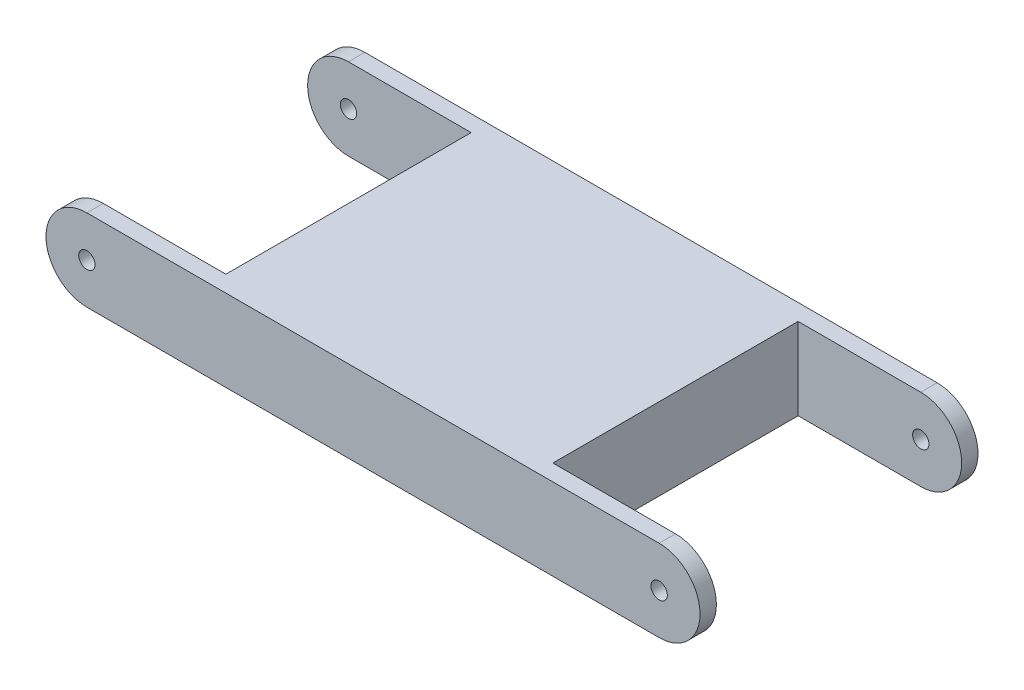
ISO-10303-21;
HEADER;
FILE_DESCRIPTION(('STEP AP214'),'2;1');
FILE_NAME('part.step','',(''),(''),'','','');
FILE_SCHEMA(('AUTOMOTIVE_DESIGN { 1 0 10303 214 1 1 1 1 }'));
ENDSEC;
DATA;
#1=APPLICATION_CONTEXT('core data for automotive mechanical design processes');
#2=APPLICATION_PROTOCOL_DEFINITION('international standard','automotive_design',2000,#1);
#3=PRODUCT_CONTEXT('',#1,'mechanical');
#4=PRODUCT('Part','Part','',(#3));
#5=PRODUCT_RELATED_PRODUCT_CATEGORY('part','',(#4));
#6=PRODUCT_DEFINITION_FORMATION('','',#4);
#7=PRODUCT_DEFINITION_CONTEXT('part definition',#1,'design');
#8=PRODUCT_DEFINITION('design','',#6,#7);
#9=PRODUCT_DEFINITION_SHAPE('','',#8);
#10=(LENGTH_UNIT() NAMED_UNIT(*) SI_UNIT(.MILLI.,.METRE.));
#11=(NAMED_UNIT(*) PLANE_ANGLE_UNIT() SI_UNIT($,.RADIAN.));
#12=(NAMED_UNIT(*) SI_UNIT($,.STERADIAN.) SOLID_ANGLE_UNIT());
#13=UNCERTAINTY_MEASURE_WITH_UNIT(LENGTH_MEASURE(1.E-05),#10,'distance_accuracy_value','');
#14=(GEOMETRIC_REPRESENTATION_CONTEXT(3) GLOBAL_UNCERTAINTY_ASSIGNED_CONTEXT((#13)) GLOBAL_UNIT_ASSIGNED_CONTEXT((#10,
#11,#12)) REPRESENTATION_CONTEXT('',''));
#15=CARTESIAN_POINT('',(0.,0.,0.));
#16=DIRECTION('',(0.,0.,1.));
#17=DIRECTION('',(1.,0.,0.));
#18=AXIS2_PLACEMENT_3D('',#15,#16,#17);
#19=CARTESIAN_POINT('',(-35.,-5.,34.));
#20=DIRECTION('',(0.,1.,0.));
#21=DIRECTION('',(0.,0.,1.));
#22=AXIS2_PLACEMENT_3D('',#19,#20,#21);
#23=PLANE('',#22);
#24=DIRECTION('',(1.,0.,0.));
#25=VECTOR('',#24,1.);
#26=CARTESIAN_POINT('',(-35.,-5.,2.));
#27=LINE('',#26,#25);
#28=CARTESIAN_POINT('',(20.,-5.,2.));
#29=VERTEX_POINT('',#28);
#30=CARTESIAN_POINT('',(35.,-5.,2.));
#31=VERTEX_POINT('',#30);
#32=EDGE_CURVE('E154',#29,#31,#27,.T.);
#33=ORIENTED_EDGE('',*,*,#32,.F.);
#34=DIRECTION('',(0.,0.,-1.));
#35=VECTOR('',#34,1.);
#36=CARTESIAN_POINT('',(20.,-5.,34.));
#37=LINE('',#36,#35);
#38=CARTESIAN_POINT('',(20.,-5.,32.));
#39=VERTEX_POINT('',#38);
#40=EDGE_CURVE('E156',#39,#29,#37,.T.);
#41=ORIENTED_EDGE('',*,*,#40,.F.);
#42=DIRECTION('',(-1.,0.,0.));
#43=VECTOR('',#42,1.);
#44=CARTESIAN_POINT('',(-35.,-5.,32.));
#45=LINE('',#44,#43);
#46=CARTESIAN_POINT('',(35.,-5.,32.));
#47=VERTEX_POINT('',#46);
#48=EDGE_CURVE('E138',#47,#39,#45,.T.);
#49=ORIENTED_EDGE('',*,*,#48,.F.);
#50=DIRECTION('',(0.,0.,-1.));
#51=VECTOR('',#50,1.);
#52=CARTESIAN_POINT('',(35.,-5.,34.));
#53=LINE('',#52,#51);
#54=CARTESIAN_POINT('',(35.,-5.,34.));
#55=VERTEX_POINT('',#54);
#56=EDGE_CURVE('E214',#55,#47,#53,.T.);
#57=ORIENTED_EDGE('',*,*,#56,.F.);
#58=DIRECTION('',(1.,0.,0.));
#59=VECTOR('',#58,1.);
#60=CARTESIAN_POINT('',(-35.,-5.,34.));
#61=LINE('',#60,#59);
#62=CARTESIAN_POINT('',(-35.,-5.,34.));
#63=VERTEX_POINT('',#62);
#64=EDGE_CURVE('E189',#63,#55,#61,.T.);
#65=ORIENTED_EDGE('',*,*,#64,.F.);
#66=DIRECTION('',(0.,0.,-1.));
#67=VECTOR('',#66,1.);
#68=CARTESIAN_POINT('',(-35.,-5.,34.));
#69=LINE('',#68,#67);
#70=CARTESIAN_POINT('',(-35.,-5.,32.));
#71=VERTEX_POINT('',#70);
#72=EDGE_CURVE('E217',#63,#71,#69,.T.);
#73=ORIENTED_EDGE('',*,*,#72,.T.);
#74=DIRECTION('',(-1.,0.,0.));
#75=VECTOR('',#74,1.);
#76=CARTESIAN_POINT('',(-35.,-5.,32.));
#77=LINE('',#76,#75);
#78=CARTESIAN_POINT('',(-20.,-5.,32.));
#79=VERTEX_POINT('',#78);
#80=EDGE_CURVE('E174',#79,#71,#77,.T.);
#81=ORIENTED_EDGE('',*,*,#80,.F.);
#82=DIRECTION('',(0.,0.,1.));
#83=VECTOR('',#82,1.);
#84=CARTESIAN_POINT('',(-20.,-5.,34.));
#85=LINE('',#84,#83);
#86=CARTESIAN_POINT('',(-20.,-5.,2.));
#87=VERTEX_POINT('',#86);
#88=EDGE_CURVE('E176',#87,#79,#85,.T.);
#89=ORIENTED_EDGE('',*,*,#88,.F.);
#90=DIRECTION('',(1.,0.,0.));
#91=VECTOR('',#90,1.);
#92=CARTESIAN_POINT('',(-35.,-5.,2.));
#93=LINE('',#92,#91);
#94=CARTESIAN_POINT('',(-35.,-5.,2.));
#95=VERTEX_POINT('',#94);
#96=EDGE_CURVE('E167',#95,#87,#93,.T.);
#97=ORIENTED_EDGE('',*,*,#96,.F.);
#98=CARTESIAN_POINT('',(-35.,-5.,0.));
#99=VERTEX_POINT('',#98);
#100=EDGE_CURVE('E216',#95,#99,#69,.T.);
#101=ORIENTED_EDGE('',*,*,#100,.T.);
#102=DIRECTION('',(1.,0.,0.));
#103=VECTOR('',#102,1.);
#104=CARTESIAN_POINT('',(-35.,-5.,0.));
#105=LINE('',#104,#103);
#106=CARTESIAN_POINT('',(35.,-5.,0.));
#107=VERTEX_POINT('',#106);
#108=EDGE_CURVE('E200',#99,#107,#105,.T.);
#109=ORIENTED_EDGE('',*,*,#108,.T.);
#110=EDGE_CURVE('E213',#31,#107,#53,.T.);
#111=ORIENTED_EDGE('',*,*,#110,.F.);
#112=EDGE_LOOP('',(#33,#41,#49,#57,#65,#73,#81,#89,#97,#101,#109,#111));
#113=FACE_BOUND('',#112,.T.);
#114=ADVANCED_FACE('F33',(#113),#23,.F.);
#115=CARTESIAN_POINT('',(-35.,5.,34.));
#116=DIRECTION('',(0.,-1.,0.));
#117=DIRECTION('',(0.,0.,-1.));
#118=AXIS2_PLACEMENT_3D('',#115,#116,#117);
#119=PLANE('',#118);
#120=DIRECTION('',(-1.,0.,0.));
#121=VECTOR('',#120,1.);
#122=CARTESIAN_POINT('',(-35.,5.,2.));
#123=LINE('',#122,#121);
#124=CARTESIAN_POINT('',(35.,5.,2.));
#125=VERTEX_POINT('',#124);
#126=CARTESIAN_POINT('',(20.,5.,2.));
#127=VERTEX_POINT('',#126);
#128=EDGE_CURVE('E152',#125,#127,#123,.T.);
#129=ORIENTED_EDGE('',*,*,#128,.F.);
#130=DIRECTION('',(0.,0.,-1.));
#131=VECTOR('',#130,1.);
#132=CARTESIAN_POINT('',(35.,5.,34.));
#133=LINE('',#132,#131);
#134=CARTESIAN_POINT('',(35.,5.,0.));
#135=VERTEX_POINT('',#134);
#136=EDGE_CURVE('E211',#125,#135,#133,.T.);
#137=ORIENTED_EDGE('',*,*,#136,.T.);
#138=DIRECTION('',(-1.,0.,0.));
#139=VECTOR('',#138,1.);
#140=CARTESIAN_POINT('',(-35.,5.,0.));
#141=LINE('',#140,#139);
#142=CARTESIAN_POINT('',(-35.,5.,0.));
#143=VERTEX_POINT('',#142);
#144=EDGE_CURVE('E190',#135,#143,#141,.T.);
#145=ORIENTED_EDGE('',*,*,#144,.T.);
#146=DIRECTION('',(0.,0.,-1.));
#147=VECTOR('',#146,1.);
#148=CARTESIAN_POINT('',(-35.,5.,34.));
#149=LINE('',#148,#147);
#150=CARTESIAN_POINT('',(-35.,5.,2.));
#151=VERTEX_POINT('',#150);
#152=EDGE_CURVE('E196',#151,#143,#149,.T.);
#153=ORIENTED_EDGE('',*,*,#152,.F.);
#154=DIRECTION('',(-1.,0.,0.));
#155=VECTOR('',#154,1.);
#156=CARTESIAN_POINT('',(-35.,5.,2.));
#157=LINE('',#156,#155);
#158=CARTESIAN_POINT('',(-20.,5.,2.));
#159=VERTEX_POINT('',#158);
#160=EDGE_CURVE('E163',#159,#151,#157,.T.);
#161=ORIENTED_EDGE('',*,*,#160,.F.);
#162=DIRECTION('',(0.,0.,-1.));
#163=VECTOR('',#162,1.);
#164=CARTESIAN_POINT('',(-20.,5.,34.));
#165=LINE('',#164,#163);
#166=CARTESIAN_POINT('',(-20.,5.,32.));
#167=VERTEX_POINT('',#166);
#168=EDGE_CURVE('E41',#167,#159,#165,.T.);
#169=ORIENTED_EDGE('',*,*,#168,.F.);
#170=DIRECTION('',(1.,0.,0.));
#171=VECTOR('',#170,1.);
#172=CARTESIAN_POINT('',(-35.,5.,32.));
#173=LINE('',#172,#171);
#174=CARTESIAN_POINT('',(-35.,5.,32.));
#175=VERTEX_POINT('',#174);
#176=EDGE_CURVE('E170',#175,#167,#173,.T.);
#177=ORIENTED_EDGE('',*,*,#176,.F.);
#178=CARTESIAN_POINT('',(-35.,5.,34.));
#179=VERTEX_POINT('',#178);
#180=EDGE_CURVE('E208',#179,#175,#149,.T.);
#181=ORIENTED_EDGE('',*,*,#180,.F.);
#182=DIRECTION('',(-1.,0.,0.));
#183=VECTOR('',#182,1.);
#184=CARTESIAN_POINT('',(-35.,5.,34.));
#185=LINE('',#184,#183);
#186=CARTESIAN_POINT('',(35.,5.,34.));
#187=VERTEX_POINT('',#186);
#188=EDGE_CURVE('E194',#187,#179,#185,.T.);
#189=ORIENTED_EDGE('',*,*,#188,.F.);
#190=CARTESIAN_POINT('',(35.,5.,32.));
#191=VERTEX_POINT('',#190);
#192=EDGE_CURVE('E142',#187,#191,#133,.T.);
#193=ORIENTED_EDGE('',*,*,#192,.T.);
#194=DIRECTION('',(1.,0.,0.));
#195=VECTOR('',#194,1.);
#196=CARTESIAN_POINT('',(-35.,5.,32.));
#197=LINE('',#196,#195);
#198=CARTESIAN_POINT('',(20.,5.,32.));
#199=VERTEX_POINT('',#198);
#200=EDGE_CURVE('E135',#199,#191,#197,.T.);
#201=ORIENTED_EDGE('',*,*,#200,.F.);
#202=DIRECTION('',(0.,0.,1.));
#203=VECTOR('',#202,1.);
#204=CARTESIAN_POINT('',(20.,5.,34.));
#205=LINE('',#204,#203);
#206=EDGE_CURVE('E11',#127,#199,#205,.T.);
#207=ORIENTED_EDGE('',*,*,#206,.F.);
#208=EDGE_LOOP('',(#129,#137,#145,#153,#161,#169,#177,#181,#189,#193,#201,#207));
#209=FACE_BOUND('',#208,.T.);
#210=ADVANCED_FACE('F140',(#209),#119,.F.);
#211=CARTESIAN_POINT('',(35.,0.,34.));
#212=DIRECTION('',(0.,0.,-1.));
#213=DIRECTION('',(-1.,0.,0.));
#214=AXIS2_PLACEMENT_3D('',#211,#212,#213);
#215=CYLINDRICAL_SURFACE('',#214,5.);
#216=ORIENTED_EDGE('',*,*,#136,.F.);
#217=CARTESIAN_POINT('',(35.,0.,2.));
#218=DIRECTION('',(0.,0.,1.));
#219=DIRECTION('',(1.,0.,0.));
#220=AXIS2_PLACEMENT_3D('',#217,#218,#219);
#221=CIRCLE('',#220,5.);
#222=EDGE_CURVE('E150',#31,#125,#221,.T.);
#223=ORIENTED_EDGE('',*,*,#222,.F.);
#224=ORIENTED_EDGE('',*,*,#110,.T.);
#225=CARTESIAN_POINT('',(35.,0.,0.));
#226=DIRECTION('',(0.,0.,1.));
#227=DIRECTION('',(1.,0.,0.));
#228=AXIS2_PLACEMENT_3D('',#225,#226,#227);
#229=CIRCLE('',#228,5.);
#230=EDGE_CURVE('E203',#107,#135,#229,.T.);
#231=ORIENTED_EDGE('',*,*,#230,.T.);
#232=EDGE_LOOP('',(#216,#223,#224,#231));
#233=FACE_BOUND('',#232,.T.);
#234=ADVANCED_FACE('F245',(#233),#215,.T.);
#235=CARTESIAN_POINT('',(35.,0.,32.));
#236=DIRECTION('',(0.,0.,-1.));
#237=DIRECTION('',(-1.,0.,0.));
#238=AXIS2_PLACEMENT_3D('',#235,#236,#237);
#239=CIRCLE('',#238,5.);
#240=EDGE_CURVE('E48',#191,#47,#239,.T.);
#241=ORIENTED_EDGE('',*,*,#240,.F.);
#242=ORIENTED_EDGE('',*,*,#192,.F.);
#243=CARTESIAN_POINT('',(35.,0.,34.));
#244=DIRECTION('',(0.,0.,1.));
#245=DIRECTION('',(1.,0.,0.));
#246=AXIS2_PLACEMENT_3D('',#243,#244,#245);
#247=CIRCLE('',#246,5.);
#248=EDGE_CURVE('E192',#55,#187,#247,.T.);
#249=ORIENTED_EDGE('',*,*,#248,.F.);
#250=ORIENTED_EDGE('',*,*,#56,.T.);
#251=EDGE_LOOP('',(#241,#242,#249,#250));
#252=FACE_BOUND('',#251,.T.);
#253=ADVANCED_FACE('F282',(#252),#215,.T.);
#254=CARTESIAN_POINT('',(35.,0.,34.));
#255=DIRECTION('',(0.,0.,-1.));
#256=DIRECTION('',(-1.,0.,0.));
#257=AXIS2_PLACEMENT_3D('',#254,#255,#256);
#258=CYLINDRICAL_SURFACE('',#257,0.999999999999998);
#259=CARTESIAN_POINT('',(35.,0.,0.));
#260=DIRECTION('',(0.,0.,1.));
#261=DIRECTION('',(1.,0.,0.));
#262=AXIS2_PLACEMENT_3D('',#259,#260,#261);
#263=CIRCLE('',#262,0.999999999999998);
#264=CARTESIAN_POINT('',(36.,0.,0.));
#265=VERTEX_POINT('',#264);
#266=EDGE_CURVE('E181',#265,#265,#263,.F.);
#267=ORIENTED_EDGE('',*,*,#266,.T.);
#268=EDGE_LOOP('',(#267));
#269=FACE_BOUND('',#268,.T.);
#270=CARTESIAN_POINT('',(35.,0.,2.));
#271=DIRECTION('',(0.,0.,1.));
#272=DIRECTION('',(1.,0.,0.));
#273=AXIS2_PLACEMENT_3D('',#270,#271,#272);
#274=CIRCLE('',#273,0.999999999999998);
#275=CARTESIAN_POINT('',(36.,0.,2.));
#276=VERTEX_POINT('',#275);
#277=EDGE_CURVE('E144',#276,#276,#274,.T.);
#278=ORIENTED_EDGE('',*,*,#277,.T.);
#279=EDGE_LOOP('',(#278));
#280=FACE_BOUND('',#279,.T.);
#281=ADVANCED_FACE('F233',(#269,#280),#258,.F.);
#282=CARTESIAN_POINT('',(35.,0.,34.));
#283=DIRECTION('',(0.,0.,1.));
#284=DIRECTION('',(-1.,0.,0.));
#285=AXIS2_PLACEMENT_3D('',#282,#283,#284);
#286=CIRCLE('',#285,0.999999999999998);
#287=CARTESIAN_POINT('',(34.,0.,34.));
#288=VERTEX_POINT('',#287);
#289=EDGE_CURVE('E178',#288,#288,#286,.T.);
#290=ORIENTED_EDGE('',*,*,#289,.T.);
#291=EDGE_LOOP('',(#290));
#292=FACE_BOUND('',#291,.T.);
#293=CARTESIAN_POINT('',(35.,0.,32.));
#294=DIRECTION('',(0.,0.,-1.));
#295=DIRECTION('',(-1.,0.,0.));
#296=AXIS2_PLACEMENT_3D('',#293,#294,#295);
#297=CIRCLE('',#296,0.999999999999998);
#298=CARTESIAN_POINT('',(34.,0.,32.));
#299=VERTEX_POINT('',#298);
#300=EDGE_CURVE('E146',#299,#299,#297,.T.);
#301=ORIENTED_EDGE('',*,*,#300,.T.);
#302=EDGE_LOOP('',(#301));
#303=FACE_BOUND('',#302,.T.);
#304=ADVANCED_FACE('F297',(#292,#303),#258,.F.);
#305=CARTESIAN_POINT('',(-35.,0.,34.));
#306=DIRECTION('',(0.,0.,-1.));
#307=DIRECTION('',(-1.,0.,0.));
#308=AXIS2_PLACEMENT_3D('',#305,#306,#307);
#309=CYLINDRICAL_SURFACE('',#308,5.);
#310=ORIENTED_EDGE('',*,*,#180,.T.);
#311=CARTESIAN_POINT('',(-35.,0.,32.));
#312=DIRECTION('',(0.,0.,-1.));
#313=DIRECTION('',(-1.,0.,0.));
#314=AXIS2_PLACEMENT_3D('',#311,#312,#313);
#315=CIRCLE('',#314,5.);
#316=EDGE_CURVE('E172',#71,#175,#315,.T.);
#317=ORIENTED_EDGE('',*,*,#316,.F.);
#318=ORIENTED_EDGE('',*,*,#72,.F.);
#319=CARTESIAN_POINT('',(-35.,0.,34.));
#320=DIRECTION('',(0.,0.,1.));
#321=DIRECTION('',(1.,0.,0.));
#322=AXIS2_PLACEMENT_3D('',#319,#320,#321);
#323=CIRCLE('',#322,5.);
#324=EDGE_CURVE('E186',#179,#63,#323,.T.);
#325=ORIENTED_EDGE('',*,*,#324,.F.);
#326=EDGE_LOOP('',(#310,#317,#318,#325));
#327=FACE_BOUND('',#326,.T.);
#328=ADVANCED_FACE('F35',(#327),#309,.T.);
#329=CARTESIAN_POINT('',(-35.,0.,2.));
#330=DIRECTION('',(0.,0.,1.));
#331=DIRECTION('',(1.,0.,0.));
#332=AXIS2_PLACEMENT_3D('',#329,#330,#331);
#333=CIRCLE('',#332,5.);
#334=EDGE_CURVE('E165',#151,#95,#333,.T.);
#335=ORIENTED_EDGE('',*,*,#334,.F.);
#336=ORIENTED_EDGE('',*,*,#152,.T.);
#337=CARTESIAN_POINT('',(-35.,0.,0.));
#338=DIRECTION('',(0.,0.,1.));
#339=DIRECTION('',(1.,0.,0.));
#340=AXIS2_PLACEMENT_3D('',#337,#338,#339);
#341=CIRCLE('',#340,5.);
#342=EDGE_CURVE('E197',#143,#99,#341,.T.);
#343=ORIENTED_EDGE('',*,*,#342,.T.);
#344=ORIENTED_EDGE('',*,*,#100,.F.);
#345=EDGE_LOOP('',(#335,#336,#343,#344));
#346=FACE_BOUND('',#345,.T.);
#347=ADVANCED_FACE('F259',(#346),#309,.T.);
#348=CARTESIAN_POINT('',(-35.,0.,34.));
#349=DIRECTION('',(0.,0.,-1.));
#350=DIRECTION('',(-1.,0.,0.));
#351=AXIS2_PLACEMENT_3D('',#348,#349,#350);
#352=CYLINDRICAL_SURFACE('',#351,0.999999999999998);
#353=CARTESIAN_POINT('',(-35.,0.,34.));
#354=DIRECTION('',(0.,0.,1.));
#355=DIRECTION('',(1.,0.,0.));
#356=AXIS2_PLACEMENT_3D('',#353,#354,#355);
#357=CIRCLE('',#356,0.999999999999998);
#358=CARTESIAN_POINT('',(-34.,0.,34.));
#359=VERTEX_POINT('',#358);
#360=EDGE_CURVE('E182',#359,#359,#357,.T.);
#361=ORIENTED_EDGE('',*,*,#360,.T.);
#362=EDGE_LOOP('',(#361));
#363=FACE_BOUND('',#362,.T.);
#364=CARTESIAN_POINT('',(-35.,0.,32.));
#365=DIRECTION('',(0.,0.,-1.));
#366=DIRECTION('',(-1.,0.,0.));
#367=AXIS2_PLACEMENT_3D('',#364,#365,#366);
#368=CIRCLE('',#367,0.999999999999998);
#369=CARTESIAN_POINT('',(-36.,0.,32.));
#370=VERTEX_POINT('',#369);
#371=EDGE_CURVE('E169',#370,#370,#368,.T.);
#372=ORIENTED_EDGE('',*,*,#371,.T.);
#373=EDGE_LOOP('',(#372));
#374=FACE_BOUND('',#373,.T.);
#375=ADVANCED_FACE('F292',(#363,#374),#352,.F.);
#376=CARTESIAN_POINT('',(-35.,0.,0.));
#377=DIRECTION('',(0.,0.,1.));
#378=DIRECTION('',(1.,0.,0.));
#379=AXIS2_PLACEMENT_3D('',#376,#377,#378);
#380=CIRCLE('',#379,0.999999999999998);
#381=CARTESIAN_POINT('',(-34.,0.,0.));
#382=VERTEX_POINT('',#381);
#383=EDGE_CURVE('E185',#382,#382,#380,.F.);
#384=ORIENTED_EDGE('',*,*,#383,.T.);
#385=EDGE_LOOP('',(#384));
#386=FACE_BOUND('',#385,.T.);
#387=CARTESIAN_POINT('',(-35.,0.,2.));
#388=DIRECTION('',(0.,0.,1.));
#389=DIRECTION('',(1.,0.,0.));
#390=AXIS2_PLACEMENT_3D('',#387,#388,#389);
#391=CIRCLE('',#390,0.999999999999998);
#392=CARTESIAN_POINT('',(-34.,0.,2.));
#393=VERTEX_POINT('',#392);
#394=EDGE_CURVE('E162',#393,#393,#391,.T.);
#395=ORIENTED_EDGE('',*,*,#394,.T.);
#396=EDGE_LOOP('',(#395));
#397=FACE_BOUND('',#396,.T.);
#398=ADVANCED_FACE('F290',(#386,#397),#352,.F.);
#399=CARTESIAN_POINT('',(-35.,0.,34.));
#400=DIRECTION('',(0.,0.,1.));
#401=DIRECTION('',(1.,0.,0.));
#402=AXIS2_PLACEMENT_3D('',#399,#400,#401);
#403=PLANE('',#402);
#404=ORIENTED_EDGE('',*,*,#360,.F.);
#405=EDGE_LOOP('',(#404));
#406=FACE_BOUND('',#405,.T.);
#407=ORIENTED_EDGE('',*,*,#324,.T.);
#408=ORIENTED_EDGE('',*,*,#64,.T.);
#409=ORIENTED_EDGE('',*,*,#248,.T.);
#410=ORIENTED_EDGE('',*,*,#188,.T.);
#411=EDGE_LOOP('',(#407,#408,#409,#410));
#412=FACE_BOUND('',#411,.T.);
#413=ORIENTED_EDGE('',*,*,#289,.F.);
#414=EDGE_LOOP('',(#413));
#415=FACE_BOUND('',#414,.T.);
#416=ADVANCED_FACE('F286',(#406,#412,#415),#403,.T.);
#417=CARTESIAN_POINT('',(-35.,0.,0.));
#418=DIRECTION('',(0.,0.,1.));
#419=DIRECTION('',(1.,0.,0.));
#420=AXIS2_PLACEMENT_3D('',#417,#418,#419);
#421=PLANE('',#420);
#422=ORIENTED_EDGE('',*,*,#383,.F.);
#423=EDGE_LOOP('',(#422));
#424=FACE_BOUND('',#423,.T.);
#425=ORIENTED_EDGE('',*,*,#342,.F.);
#426=ORIENTED_EDGE('',*,*,#144,.F.);
#427=ORIENTED_EDGE('',*,*,#230,.F.);
#428=ORIENTED_EDGE('',*,*,#108,.F.);
#429=EDGE_LOOP('',(#425,#426,#427,#428));
#430=FACE_BOUND('',#429,.T.);
#431=ORIENTED_EDGE('',*,*,#266,.F.);
#432=EDGE_LOOP('',(#431));
#433=FACE_BOUND('',#432,.T.);
#434=ADVANCED_FACE('F253',(#424,#430,#433),#421,.F.);
#435=CARTESIAN_POINT('',(-20.,30.,2.));
#436=DIRECTION('',(-1.,0.,0.));
#437=DIRECTION('',(0.,0.,1.));
#438=AXIS2_PLACEMENT_3D('',#435,#436,#437);
#439=PLANE('',#438);
#440=ORIENTED_EDGE('',*,*,#88,.T.);
#441=DIRECTION('',(0.,-1.,0.));
#442=VECTOR('',#441,1.);
#443=CARTESIAN_POINT('',(-20.,30.,32.));
#444=LINE('',#443,#442);
#445=EDGE_CURVE('E159',#167,#79,#444,.T.);
#446=ORIENTED_EDGE('',*,*,#445,.F.);
#447=ORIENTED_EDGE('',*,*,#168,.T.);
#448=DIRECTION('',(0.,-1.,0.));
#449=VECTOR('',#448,1.);
#450=CARTESIAN_POINT('',(-20.,30.,2.));
#451=LINE('',#450,#449);
#452=EDGE_CURVE('E56',#159,#87,#451,.T.);
#453=ORIENTED_EDGE('',*,*,#452,.T.);
#454=EDGE_LOOP('',(#440,#446,#447,#453));
#455=FACE_BOUND('',#454,.T.);
#456=ADVANCED_FACE('F270',(#455),#439,.T.);
#457=CARTESIAN_POINT('',(-40.,30.,32.));
#458=DIRECTION('',(0.,0.,-1.));
#459=DIRECTION('',(-1.,0.,0.));
#460=AXIS2_PLACEMENT_3D('',#457,#458,#459);
#461=PLANE('',#460);
#462=ORIENTED_EDGE('',*,*,#371,.F.);
#463=EDGE_LOOP('',(#462));
#464=FACE_BOUND('',#463,.T.);
#465=ORIENTED_EDGE('',*,*,#80,.T.);
#466=ORIENTED_EDGE('',*,*,#316,.T.);
#467=ORIENTED_EDGE('',*,*,#176,.T.);
#468=ORIENTED_EDGE('',*,*,#445,.T.);
#469=EDGE_LOOP('',(#465,#466,#467,#468));
#470=FACE_BOUND('',#469,.T.);
#471=ADVANCED_FACE('F262',(#464,#470),#461,.T.);
#472=CARTESIAN_POINT('',(-40.,30.,2.));
#473=DIRECTION('',(0.,0.,1.));
#474=DIRECTION('',(1.,0.,0.));
#475=AXIS2_PLACEMENT_3D('',#472,#473,#474);
#476=PLANE('',#475);
#477=ORIENTED_EDGE('',*,*,#394,.F.);
#478=EDGE_LOOP('',(#477));
#479=FACE_BOUND('',#478,.T.);
#480=ORIENTED_EDGE('',*,*,#96,.T.);
#481=ORIENTED_EDGE('',*,*,#452,.F.);
#482=ORIENTED_EDGE('',*,*,#160,.T.);
#483=ORIENTED_EDGE('',*,*,#334,.T.);
#484=EDGE_LOOP('',(#480,#481,#482,#483));
#485=FACE_BOUND('',#484,.T.);
#486=ADVANCED_FACE('F260',(#479,#485),#476,.T.);
#487=CARTESIAN_POINT('',(20.,30.,2.));
#488=DIRECTION('',(1.,0.,0.));
#489=DIRECTION('',(0.,0.,-1.));
#490=AXIS2_PLACEMENT_3D('',#487,#488,#489);
#491=PLANE('',#490);
#492=ORIENTED_EDGE('',*,*,#40,.T.);
#493=DIRECTION('',(0.,-1.,0.));
#494=VECTOR('',#493,1.);
#495=CARTESIAN_POINT('',(20.,30.,2.));
#496=LINE('',#495,#494);
#497=EDGE_CURVE('E129',#127,#29,#496,.T.);
#498=ORIENTED_EDGE('',*,*,#497,.F.);
#499=ORIENTED_EDGE('',*,*,#206,.T.);
#500=DIRECTION('',(0.,-1.,0.));
#501=VECTOR('',#500,1.);
#502=CARTESIAN_POINT('',(20.,30.,32.));
#503=LINE('',#502,#501);
#504=EDGE_CURVE('E126',#199,#39,#503,.T.);
#505=ORIENTED_EDGE('',*,*,#504,.T.);
#506=EDGE_LOOP('',(#492,#498,#499,#505));
#507=FACE_BOUND('',#506,.T.);
#508=ADVANCED_FACE('F125',(#507),#491,.T.);
#509=CARTESIAN_POINT('',(40.,30.,2.));
#510=DIRECTION('',(0.,0.,1.));
#511=DIRECTION('',(1.,0.,0.));
#512=AXIS2_PLACEMENT_3D('',#509,#510,#511);
#513=PLANE('',#512);
#514=ORIENTED_EDGE('',*,*,#277,.F.);
#515=EDGE_LOOP('',(#514));
#516=FACE_BOUND('',#515,.T.);
#517=ORIENTED_EDGE('',*,*,#32,.T.);
#518=ORIENTED_EDGE('',*,*,#222,.T.);
#519=ORIENTED_EDGE('',*,*,#128,.T.);
#520=ORIENTED_EDGE('',*,*,#497,.T.);
#521=EDGE_LOOP('',(#517,#518,#519,#520));
#522=FACE_BOUND('',#521,.T.);
#523=ADVANCED_FACE('F235',(#516,#522),#513,.T.);
#524=CARTESIAN_POINT('',(40.,30.,32.));
#525=DIRECTION('',(0.,0.,-1.));
#526=DIRECTION('',(-1.,0.,0.));
#527=AXIS2_PLACEMENT_3D('',#524,#525,#526);
#528=PLANE('',#527);
#529=ORIENTED_EDGE('',*,*,#300,.F.);
#530=EDGE_LOOP('',(#529));
#531=FACE_BOUND('',#530,.T.);
#532=ORIENTED_EDGE('',*,*,#48,.T.);
#533=ORIENTED_EDGE('',*,*,#504,.F.);
#534=ORIENTED_EDGE('',*,*,#200,.T.);
#535=ORIENTED_EDGE('',*,*,#240,.T.);
#536=EDGE_LOOP('',(#532,#533,#534,#535));
#537=FACE_BOUND('',#536,.T.);
#538=ADVANCED_FACE('F134',(#531,#537),#528,.T.);
#539=CLOSED_SHELL('',(#114,#210,#234,#253,#281,#304,#328,#347,#375,#398,#416,#434,#456,#471,
#486,#508,#523,#538));
#540=MANIFOLD_SOLID_BREP('B2',#539);
#541=ADVANCED_BREP_SHAPE_REPRESENTATION('',(#18,#540),#14);
#542=SHAPE_DEFINITION_REPRESENTATION(#9,#541);
ENDSEC;
END-ISO-10303-21;
